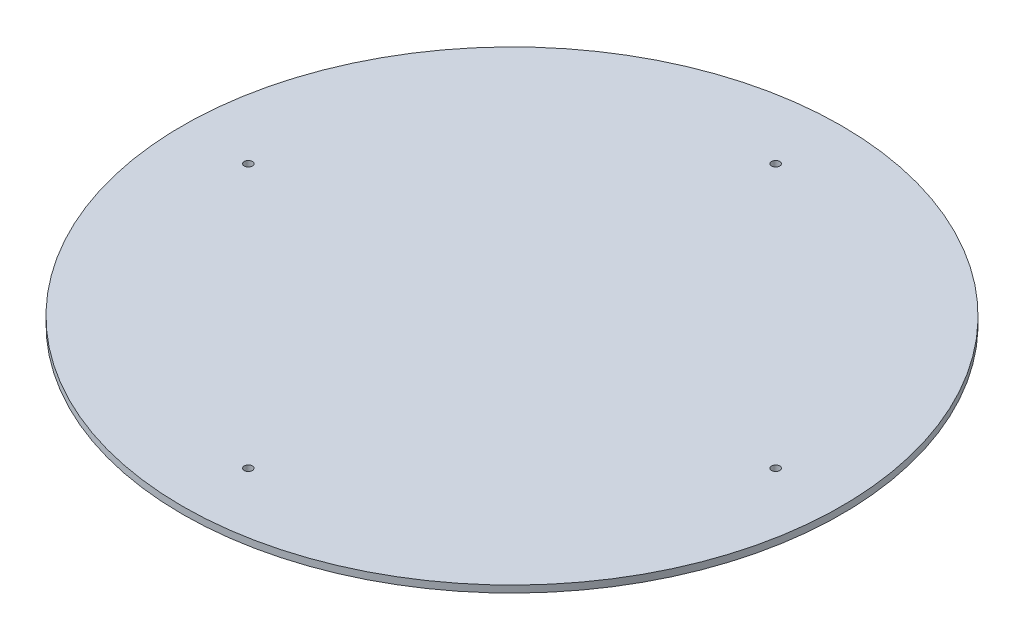
ISO-10303-21;
HEADER;
FILE_DESCRIPTION(('STEP AP214'),'2;1');
FILE_NAME('part.step','',(''),(''),'','','');
FILE_SCHEMA(('AUTOMOTIVE_DESIGN { 1 0 10303 214 1 1 1 1 }'));
ENDSEC;
DATA;
#1=APPLICATION_CONTEXT('core data for automotive mechanical design processes');
#2=APPLICATION_PROTOCOL_DEFINITION('international standard','automotive_design',2000,#1);
#3=PRODUCT_CONTEXT('',#1,'mechanical');
#4=PRODUCT('Part','Part','',(#3));
#5=PRODUCT_RELATED_PRODUCT_CATEGORY('part','',(#4));
#6=PRODUCT_DEFINITION_FORMATION('','',#4);
#7=PRODUCT_DEFINITION_CONTEXT('part definition',#1,'design');
#8=PRODUCT_DEFINITION('design','',#6,#7);
#9=PRODUCT_DEFINITION_SHAPE('','',#8);
#10=(LENGTH_UNIT() NAMED_UNIT(*) SI_UNIT(.MILLI.,.METRE.));
#11=(NAMED_UNIT(*) PLANE_ANGLE_UNIT() SI_UNIT($,.RADIAN.));
#12=(NAMED_UNIT(*) SI_UNIT($,.STERADIAN.) SOLID_ANGLE_UNIT());
#13=UNCERTAINTY_MEASURE_WITH_UNIT(LENGTH_MEASURE(1.E-05),#10,'distance_accuracy_value','');
#14=(GEOMETRIC_REPRESENTATION_CONTEXT(3) GLOBAL_UNCERTAINTY_ASSIGNED_CONTEXT((#13)) GLOBAL_UNIT_ASSIGNED_CONTEXT((#10,
#11,#12)) REPRESENTATION_CONTEXT('',''));
#15=CARTESIAN_POINT('',(0.,0.,0.));
#16=DIRECTION('',(0.,0.,1.));
#17=DIRECTION('',(1.,0.,0.));
#18=AXIS2_PLACEMENT_3D('',#15,#16,#17);
#19=CARTESIAN_POINT('',(0.,6.,0.));
#20=DIRECTION('',(0.,-1.,0.));
#21=DIRECTION('',(0.,0.,-1.));
#22=AXIS2_PLACEMENT_3D('',#19,#20,#21);
#23=CYLINDRICAL_SURFACE('',#22,285.);
#24=CARTESIAN_POINT('',(0.,6.,0.));
#25=DIRECTION('',(0.,1.,0.));
#26=DIRECTION('',(0.,0.,1.));
#27=AXIS2_PLACEMENT_3D('',#24,#25,#26);
#28=CIRCLE('',#27,285.);
#29=CARTESIAN_POINT('',(0.,6.,285.));
#30=VERTEX_POINT('',#29);
#31=EDGE_CURVE('E10',#30,#30,#28,.T.);
#32=ORIENTED_EDGE('',*,*,#31,.F.);
#33=EDGE_LOOP('',(#32));
#34=FACE_BOUND('',#33,.T.);
#35=CARTESIAN_POINT('',(0.,0.,0.));
#36=DIRECTION('',(0.,1.,0.));
#37=DIRECTION('',(0.,0.,1.));
#38=AXIS2_PLACEMENT_3D('',#35,#36,#37);
#39=CIRCLE('',#38,285.);
#40=CARTESIAN_POINT('',(0.,0.,285.));
#41=VERTEX_POINT('',#40);
#42=EDGE_CURVE('E34',#41,#41,#39,.T.);
#43=ORIENTED_EDGE('',*,*,#42,.T.);
#44=EDGE_LOOP('',(#43));
#45=FACE_BOUND('',#44,.T.);
#46=ADVANCED_FACE('F31',(#34,#45),#23,.T.);
#47=CARTESIAN_POINT('',(0.,6.,0.));
#48=DIRECTION('',(0.,1.,0.));
#49=DIRECTION('',(0.,0.,1.));
#50=AXIS2_PLACEMENT_3D('',#47,#48,#49);
#51=PLANE('',#50);
#52=CARTESIAN_POINT('',(228.035,6.,0.));
#53=DIRECTION('',(0.,1.,0.));
#54=DIRECTION('',(0.,0.,1.));
#55=AXIS2_PLACEMENT_3D('',#52,#53,#54);
#56=CIRCLE('',#55,3.49999999999999);
#57=CARTESIAN_POINT('',(228.035,6.,3.49999999999999));
#58=VERTEX_POINT('',#57);
#59=EDGE_CURVE('E41',#58,#58,#56,.T.);
#60=ORIENTED_EDGE('',*,*,#59,.F.);
#61=EDGE_LOOP('',(#60));
#62=FACE_BOUND('',#61,.T.);
#63=CARTESIAN_POINT('',(0.,6.,228.035));
#64=DIRECTION('',(0.,1.,0.));
#65=DIRECTION('',(0.,0.,1.));
#66=AXIS2_PLACEMENT_3D('',#63,#64,#65);
#67=CIRCLE('',#66,3.49999999999999);
#68=CARTESIAN_POINT('',(0.,6.,231.535));
#69=VERTEX_POINT('',#68);
#70=EDGE_CURVE('E58',#69,#69,#67,.T.);
#71=ORIENTED_EDGE('',*,*,#70,.F.);
#72=EDGE_LOOP('',(#71));
#73=FACE_BOUND('',#72,.T.);
#74=CARTESIAN_POINT('',(-228.035,6.,0.));
#75=DIRECTION('',(0.,1.,0.));
#76=DIRECTION('',(0.,0.,1.));
#77=AXIS2_PLACEMENT_3D('',#74,#75,#76);
#78=CIRCLE('',#77,3.49999999999996);
#79=CARTESIAN_POINT('',(-228.035,6.,3.49999999999994));
#80=VERTEX_POINT('',#79);
#81=EDGE_CURVE('E52',#80,#80,#78,.T.);
#82=ORIENTED_EDGE('',*,*,#81,.F.);
#83=EDGE_LOOP('',(#82));
#84=FACE_BOUND('',#83,.T.);
#85=CARTESIAN_POINT('',(0.,6.,-228.035));
#86=DIRECTION('',(0.,1.,0.));
#87=DIRECTION('',(0.,0.,1.));
#88=AXIS2_PLACEMENT_3D('',#85,#86,#87);
#89=CIRCLE('',#88,3.49999999999999);
#90=CARTESIAN_POINT('',(0.,6.,-224.535));
#91=VERTEX_POINT('',#90);
#92=EDGE_CURVE('E46',#91,#91,#89,.T.);
#93=ORIENTED_EDGE('',*,*,#92,.F.);
#94=EDGE_LOOP('',(#93));
#95=FACE_BOUND('',#94,.T.);
#96=ORIENTED_EDGE('',*,*,#31,.T.);
#97=EDGE_LOOP('',(#96));
#98=FACE_BOUND('',#97,.T.);
#99=ADVANCED_FACE('F70',(#62,#73,#84,#95,#98),#51,.T.);
#100=CARTESIAN_POINT('',(0.,0.,0.));
#101=DIRECTION('',(0.,1.,0.));
#102=DIRECTION('',(0.,0.,1.));
#103=AXIS2_PLACEMENT_3D('',#100,#101,#102);
#104=PLANE('',#103);
#105=CARTESIAN_POINT('',(228.035,0.,0.));
#106=DIRECTION('',(0.,1.,0.));
#107=DIRECTION('',(0.,0.,1.));
#108=AXIS2_PLACEMENT_3D('',#105,#106,#107);
#109=CIRCLE('',#108,3.49999999999999);
#110=CARTESIAN_POINT('',(228.035,0.,3.49999999999999));
#111=VERTEX_POINT('',#110);
#112=EDGE_CURVE('E61',#111,#111,#109,.T.);
#113=ORIENTED_EDGE('',*,*,#112,.T.);
#114=EDGE_LOOP('',(#113));
#115=FACE_BOUND('',#114,.T.);
#116=CARTESIAN_POINT('',(0.,0.,228.035));
#117=DIRECTION('',(0.,1.,0.));
#118=DIRECTION('',(0.,0.,1.));
#119=AXIS2_PLACEMENT_3D('',#116,#117,#118);
#120=CIRCLE('',#119,3.49999999999999);
#121=CARTESIAN_POINT('',(0.,0.,231.535));
#122=VERTEX_POINT('',#121);
#123=EDGE_CURVE('E55',#122,#122,#120,.T.);
#124=ORIENTED_EDGE('',*,*,#123,.T.);
#125=EDGE_LOOP('',(#124));
#126=FACE_BOUND('',#125,.T.);
#127=CARTESIAN_POINT('',(-228.035,0.,0.));
#128=DIRECTION('',(0.,1.,0.));
#129=DIRECTION('',(0.,0.,1.));
#130=AXIS2_PLACEMENT_3D('',#127,#128,#129);
#131=CIRCLE('',#130,3.49999999999996);
#132=CARTESIAN_POINT('',(-228.035,0.,3.49999999999994));
#133=VERTEX_POINT('',#132);
#134=EDGE_CURVE('E49',#133,#133,#131,.T.);
#135=ORIENTED_EDGE('',*,*,#134,.T.);
#136=EDGE_LOOP('',(#135));
#137=FACE_BOUND('',#136,.T.);
#138=CARTESIAN_POINT('',(0.,0.,-228.035));
#139=DIRECTION('',(0.,1.,0.));
#140=DIRECTION('',(0.,0.,1.));
#141=AXIS2_PLACEMENT_3D('',#138,#139,#140);
#142=CIRCLE('',#141,3.49999999999999);
#143=CARTESIAN_POINT('',(0.,0.,-224.535));
#144=VERTEX_POINT('',#143);
#145=EDGE_CURVE('E43',#144,#144,#142,.T.);
#146=ORIENTED_EDGE('',*,*,#145,.T.);
#147=EDGE_LOOP('',(#146));
#148=FACE_BOUND('',#147,.T.);
#149=ORIENTED_EDGE('',*,*,#42,.F.);
#150=EDGE_LOOP('',(#149));
#151=FACE_BOUND('',#150,.T.);
#152=ADVANCED_FACE('F73',(#115,#126,#137,#148,#151),#104,.F.);
#153=CARTESIAN_POINT('',(0.,6.,-228.035));
#154=DIRECTION('',(0.,-1.,0.));
#155=DIRECTION('',(0.,0.,-1.));
#156=AXIS2_PLACEMENT_3D('',#153,#154,#155);
#157=CYLINDRICAL_SURFACE('',#156,3.49999999999999);
#158=ORIENTED_EDGE('',*,*,#92,.T.);
#159=EDGE_LOOP('',(#158));
#160=FACE_BOUND('',#159,.T.);
#161=ORIENTED_EDGE('',*,*,#145,.F.);
#162=EDGE_LOOP('',(#161));
#163=FACE_BOUND('',#162,.T.);
#164=ADVANCED_FACE('F81',(#160,#163),#157,.F.);
#165=CARTESIAN_POINT('',(-228.035,6.,0.));
#166=DIRECTION('',(0.,-1.,0.));
#167=DIRECTION('',(0.,0.,-1.));
#168=AXIS2_PLACEMENT_3D('',#165,#166,#167);
#169=CYLINDRICAL_SURFACE('',#168,3.49999999999996);
#170=ORIENTED_EDGE('',*,*,#81,.T.);
#171=EDGE_LOOP('',(#170));
#172=FACE_BOUND('',#171,.T.);
#173=ORIENTED_EDGE('',*,*,#134,.F.);
#174=EDGE_LOOP('',(#173));
#175=FACE_BOUND('',#174,.T.);
#176=ADVANCED_FACE('F84',(#172,#175),#169,.F.);
#177=CARTESIAN_POINT('',(0.,6.,228.035));
#178=DIRECTION('',(0.,-1.,0.));
#179=DIRECTION('',(0.,0.,-1.));
#180=AXIS2_PLACEMENT_3D('',#177,#178,#179);
#181=CYLINDRICAL_SURFACE('',#180,3.49999999999999);
#182=ORIENTED_EDGE('',*,*,#70,.T.);
#183=EDGE_LOOP('',(#182));
#184=FACE_BOUND('',#183,.T.);
#185=ORIENTED_EDGE('',*,*,#123,.F.);
#186=EDGE_LOOP('',(#185));
#187=FACE_BOUND('',#186,.T.);
#188=ADVANCED_FACE('F115',(#184,#187),#181,.F.);
#189=CARTESIAN_POINT('',(228.035,6.,0.));
#190=DIRECTION('',(0.,-1.,0.));
#191=DIRECTION('',(0.,0.,-1.));
#192=AXIS2_PLACEMENT_3D('',#189,#190,#191);
#193=CYLINDRICAL_SURFACE('',#192,3.49999999999999);
#194=ORIENTED_EDGE('',*,*,#59,.T.);
#195=EDGE_LOOP('',(#194));
#196=FACE_BOUND('',#195,.T.);
#197=ORIENTED_EDGE('',*,*,#112,.F.);
#198=EDGE_LOOP('',(#197));
#199=FACE_BOUND('',#198,.T.);
#200=ADVANCED_FACE('F67',(#196,#199),#193,.F.);
#201=CLOSED_SHELL('',(#46,#99,#152,#164,#176,#188,#200));
#202=MANIFOLD_SOLID_BREP('B2',#201);
#203=ADVANCED_BREP_SHAPE_REPRESENTATION('',(#18,#202),#14);
#204=SHAPE_DEFINITION_REPRESENTATION(#9,#203);
ENDSEC;
END-ISO-10303-21;
